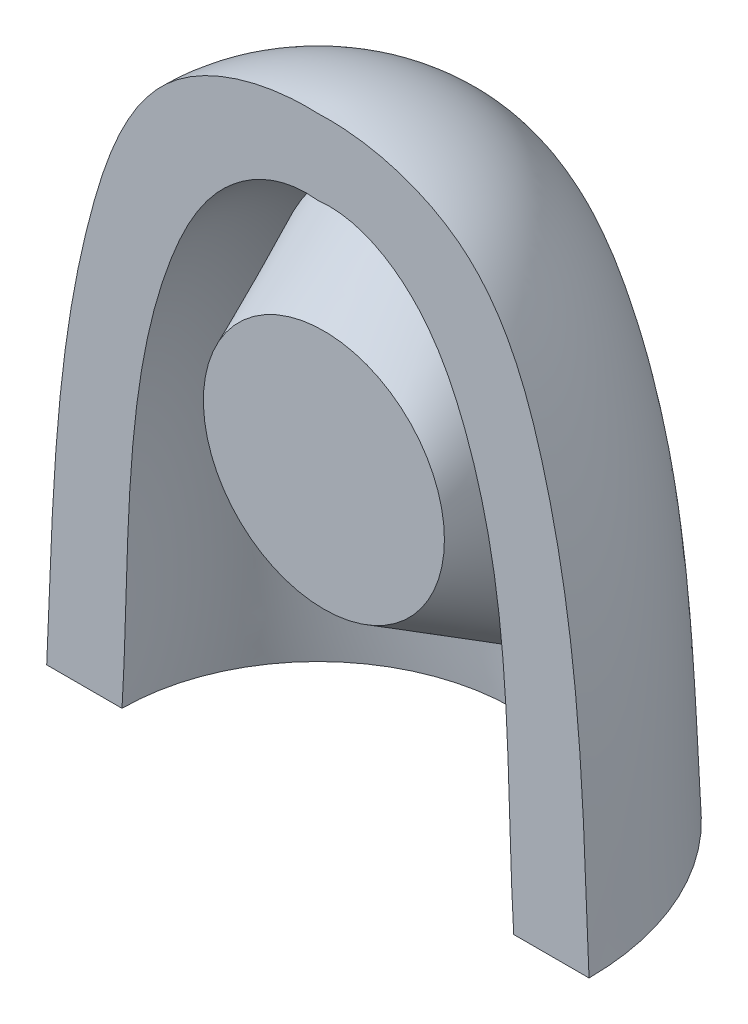
ISO-10303-21;
HEADER;
FILE_DESCRIPTION(('STEP AP214'),'2;1');
FILE_NAME('part.step','',(''),(''),'','','');
FILE_SCHEMA(('AUTOMOTIVE_DESIGN { 1 0 10303 214 1 1 1 1 }'));
ENDSEC;
DATA;
#1=APPLICATION_CONTEXT('core data for automotive mechanical design processes');
#2=APPLICATION_PROTOCOL_DEFINITION('international standard','automotive_design',2000,#1);
#3=PRODUCT_CONTEXT('',#1,'mechanical');
#4=PRODUCT('Part','Part','',(#3));
#5=PRODUCT_RELATED_PRODUCT_CATEGORY('part','',(#4));
#6=PRODUCT_DEFINITION_FORMATION('','',#4);
#7=PRODUCT_DEFINITION_CONTEXT('part definition',#1,'design');
#8=PRODUCT_DEFINITION('design','',#6,#7);
#9=PRODUCT_DEFINITION_SHAPE('','',#8);
#10=(LENGTH_UNIT() NAMED_UNIT(*) SI_UNIT(.MILLI.,.METRE.));
#11=(NAMED_UNIT(*) PLANE_ANGLE_UNIT() SI_UNIT($,.RADIAN.));
#12=(NAMED_UNIT(*) SI_UNIT($,.STERADIAN.) SOLID_ANGLE_UNIT());
#13=UNCERTAINTY_MEASURE_WITH_UNIT(LENGTH_MEASURE(1.E-05),#10,'distance_accuracy_value','');
#14=(GEOMETRIC_REPRESENTATION_CONTEXT(3) GLOBAL_UNCERTAINTY_ASSIGNED_CONTEXT((#13)) GLOBAL_UNIT_ASSIGNED_CONTEXT((#10,
#11,#12)) REPRESENTATION_CONTEXT('',''));
#15=CARTESIAN_POINT('',(0.,0.,0.));
#16=DIRECTION('',(0.,0.,1.));
#17=DIRECTION('',(1.,0.,0.));
#18=AXIS2_PLACEMENT_3D('',#15,#16,#17);
#19=CARTESIAN_POINT('',(0.,17.85,0.));
#20=CARTESIAN_POINT('',(1.24846861298638,18.0031040687306,0.));
#21=CARTESIAN_POINT('',(3.43429537377529,16.8333496800897,0.));
#22=CARTESIAN_POINT('',(6.61729731931612,10.514055415151,0.));
#23=CARTESIAN_POINT('',(6.22039885602234,4.53230718925359,0.));
#24=CARTESIAN_POINT('',(6.5,0.,0.));
#25=B_SPLINE_CURVE_WITH_KNOTS('',3,(#19,#20,#21,#22,#23,#24),.UNSPECIFIED.,.F.,.F.,(4,1,1,4),
(0.,0.174730571842795,0.328981961247271,1.),.UNSPECIFIED.);
#26=CARTESIAN_POINT('',(0.,24.0801939058172,0.));
#27=DIRECTION('',(0.,1.,0.));
#28=AXIS1_PLACEMENT('',#26,#27);
#29=SURFACE_OF_REVOLUTION('',#25,#28);
#30=CARTESIAN_POINT('',(0.0020915848185156,2.10960871057088,-6.40433988911454));
#31=CARTESIAN_POINT('',(-0.0708569881289167,2.10956412934809,-6.40436483947934));
#32=CARTESIAN_POINT('',(-0.143820161504329,2.1125245953033,-6.403039200509));
#33=CARTESIAN_POINT('',(-0.289191099643609,2.12438044368944,-6.39772245300576));
#34=CARTESIAN_POINT('',(-0.361598567726914,2.13327879978048,-6.39373000895173));
#35=CARTESIAN_POINT('',(-0.505424532298662,2.15679904663749,-6.38318046961311));
#36=CARTESIAN_POINT('',(-0.576840915376655,2.1714316581982,-6.37661857047984));
#37=CARTESIAN_POINT('',(-0.71809990100843,2.2060626964334,-6.36109977369957));
#38=CARTESIAN_POINT('',(-0.787942105151076,2.22606246532002,-6.35214227696638));
#39=CARTESIAN_POINT('',(-0.942697186108103,2.27654083775309,-6.32955644530142));
#40=CARTESIAN_POINT('',(-1.02707692664279,2.30838737906419,-6.31532097046922));
#41=CARTESIAN_POINT('',(-1.19237724724958,2.37882640621484,-6.28388464182202));
#42=CARTESIAN_POINT('',(-1.27329680390788,2.41742087093598,-6.26668291815161));
#43=CARTESIAN_POINT('',(-1.51069709547456,2.54206160076244,-6.21123456497845));
#44=CARTESIAN_POINT('',(-1.66171331327344,2.63692860289526,-6.16916119398285));
#45=CARTESIAN_POINT('',(-1.91858290965893,2.82197900959212,-6.08749022668997));
#46=CARTESIAN_POINT('',(-2.02726287588152,2.90896658572295,-6.04922631631876));
#47=CARTESIAN_POINT('',(-2.23601295083798,3.09142418062774,-5.96930464082069));
#48=CARTESIAN_POINT('',(-2.33607778371883,3.18689932541828,-5.92764482603622));
#49=CARTESIAN_POINT('',(-2.52830310506569,3.38470068355162,-5.84173474937058));
#50=CARTESIAN_POINT('',(-2.62044955110319,3.48703851756509,-5.79748011041532));
#51=CARTESIAN_POINT('',(-2.79732755531567,3.69716418454633,-5.70707165713343));
#52=CARTESIAN_POINT('',(-2.88205646899014,3.80495393979976,-5.66091717402629));
#53=CARTESIAN_POINT('',(-3.10853799753057,4.11139481180069,-5.53042036952204));
#54=CARTESIAN_POINT('',(-3.24282527731999,4.31493196323852,-5.4445497478761));
#55=CARTESIAN_POINT('',(-3.49227987021986,4.73247323282894,-5.27040050122229));
#56=CARTESIAN_POINT('',(-3.60743239095343,4.94648528481659,-5.18212007409689));
#57=CARTESIAN_POINT('',(-3.82055071137058,5.38300417592443,-5.00446370138272));
#58=CARTESIAN_POINT('',(-3.91848288010651,5.60552662657318,-4.91508596892476));
#59=CARTESIAN_POINT('',(-4.09799914477339,6.05707843877154,-4.73664231810548));
#60=CARTESIAN_POINT('',(-4.17958735677264,6.28610614540358,-4.64757632680075));
#61=CARTESIAN_POINT('',(-4.3329031953632,6.76816052659066,-4.46384822078006));
#62=CARTESIAN_POINT('',(-4.4033293994588,7.02164660056617,-4.36930482722826));
#63=CARTESIAN_POINT('',(-4.5259609673557,7.5342037376134,-4.18346426966213));
#64=CARTESIAN_POINT('',(-4.57816354728988,7.79327564757296,-4.09216760353408));
#65=CARTESIAN_POINT('',(-4.66375875292131,8.31562374402757,-3.91493301615965));
#66=CARTESIAN_POINT('',(-4.69719648700688,8.57888827010772,-3.8289826895035));
#67=CARTESIAN_POINT('',(-4.74449519890044,9.10945900848066,-3.66447599364041));
#68=CARTESIAN_POINT('',(-4.75835973517393,9.37676447718447,-3.58591828285844));
#69=CARTESIAN_POINT('',(-4.76485401570195,9.88445808285047,-3.44693358562823));
#70=CARTESIAN_POINT('',(-4.75967604204868,10.1245297451881,-3.38546177695564));
#71=CARTESIAN_POINT('',(-4.73191750734739,10.6059463532829,-3.27207753381726));
#72=CARTESIAN_POINT('',(-4.70933836996635,10.8472911932715,-3.22016431775074));
#73=CARTESIAN_POINT('',(-4.64599946393165,11.3300200492387,-3.12704250513668));
#74=CARTESIAN_POINT('',(-4.605215405899,11.5714036854306,-3.08584832677081));
#75=CARTESIAN_POINT('',(-4.50507244617037,12.0519555290966,-3.01456678155678));
#76=CARTESIAN_POINT('',(-4.44571544330206,12.2911239604724,-2.98447827999133));
#77=CARTESIAN_POINT('',(-4.33110769664228,12.6867147534407,-2.9429318331391));
#78=CARTESIAN_POINT('',(-4.28098786463004,12.8443507170639,-2.92860322335643));
#79=CARTESIAN_POINT('',(-4.17241146567782,13.1571157919313,-2.90419756863058));
#80=CARTESIAN_POINT('',(-4.11395331159204,13.3122444196474,-2.89412133454849));
#81=CARTESIAN_POINT('',(-4.02000865585465,13.5425702858932,-2.88184459356193));
#82=CARTESIAN_POINT('',(-3.98763745520783,13.6189794766683,-2.87822445088125));
#83=CARTESIAN_POINT('',(-3.92081173444161,13.7709191107547,-2.87188565262475));
#84=CARTESIAN_POINT('',(-3.88635721118352,13.8464495527419,-2.86916699840713));
#85=CARTESIAN_POINT('',(-3.77994463464216,14.0712248532689,-2.86209886685079));
#86=CARTESIAN_POINT('',(-3.7047923893066,14.2190114544797,-2.85881959205362));
#87=CARTESIAN_POINT('',(-3.54535411974324,14.5094950123395,-2.85364396907614));
#88=CARTESIAN_POINT('',(-3.46107341300462,14.6521948683952,-2.85174682070678));
#89=CARTESIAN_POINT('',(-3.28262745296555,14.9311384088015,-2.84822269511668));
#90=CARTESIAN_POINT('',(-3.18847226846649,15.0673884679704,-2.84659544697334));
#91=CARTESIAN_POINT('',(-3.01636723532609,15.2960035574114,-2.8433573257632));
#92=CARTESIAN_POINT('',(-2.94093062730496,15.3902636579433,-2.84186127406869));
#93=CARTESIAN_POINT('',(-2.78405678572373,15.573654406779,-2.83844154231021));
#94=CARTESIAN_POINT('',(-2.70262018750083,15.6627855964067,-2.83651790747951));
#95=CARTESIAN_POINT('',(-2.53361386514956,15.8348785696554,-2.83218091598689));
#96=CARTESIAN_POINT('',(-2.44605002743217,15.9178461208357,-2.82976802523316));
#97=CARTESIAN_POINT('',(-2.26463591338562,16.0766203985347,-2.82450005536822));
#98=CARTESIAN_POINT('',(-2.17078553541921,16.1524270092316,-2.82164496910687));
#99=CARTESIAN_POINT('',(-1.97560384963993,16.2966559612997,-2.81560676443468));
#100=CARTESIAN_POINT('',(-1.87418940433929,16.3649662248574,-2.81241977597319));
#101=CARTESIAN_POINT('',(-1.66535289278492,16.4917454228639,-2.80599531741932));
#102=CARTESIAN_POINT('',(-1.55793064304281,16.550214056514,-2.80275784578729));
#103=CARTESIAN_POINT('',(-1.33782318964937,16.6560416134726,-2.79656401327956));
#104=CARTESIAN_POINT('',(-1.22514236393391,16.7034095873471,-2.79360742457281));
#105=CARTESIAN_POINT('',(-0.995384991583199,16.7859556335366,-2.78827469985162));
#106=CARTESIAN_POINT('',(-0.878309501484574,16.8211366152277,-2.78589842533997));
#107=CARTESIAN_POINT('',(-0.658669435766282,16.874107624819,-2.78225533281317));
#108=CARTESIAN_POINT('',(-0.556540903823032,16.8937075049154,-2.78087598161021));
#109=CARTESIAN_POINT('',(-0.3508684837704,16.9229972507388,-2.77881256138667));
#110=CARTESIAN_POINT('',(-0.247324795738096,16.9326885029726,-2.77812839508948));
#111=CARTESIAN_POINT('',(-0.0398418284304384,16.9419499244056,-2.77751025361071));
#112=CARTESIAN_POINT('',(0.064097197811978,16.9415257392048,-2.77757585995744));
#113=CARTESIAN_POINT('',(0.271432732411801,16.9305801555938,-2.77845322670263));
#114=CARTESIAN_POINT('',(0.374829279239084,16.9200594831786,-2.77926493345203));
#115=CARTESIAN_POINT('',(0.566833758816475,16.8911511798752,-2.78142491781185));
#116=CARTESIAN_POINT('',(0.655624528932224,16.8739572531294,-2.7826902028213));
#117=CARTESIAN_POINT('',(0.831504043807087,16.8323698643011,-2.78566825391461));
#118=CARTESIAN_POINT('',(0.918592277692034,16.8079742755506,-2.78738115216254));
#119=CARTESIAN_POINT('',(1.17644842361009,16.7245203783846,-2.79306243536523));
#120=CARTESIAN_POINT('',(1.34396735602191,16.65517005955,-2.79757547059619));
#121=CARTESIAN_POINT('',(1.67617955683188,16.4880123610861,-2.80733529231591));
#122=CARTESIAN_POINT('',(1.84014729522356,16.3887895033268,-2.81260943661007));
#123=CARTESIAN_POINT('',(2.15263470176869,16.1685671174152,-2.82251749502565));
#124=CARTESIAN_POINT('',(2.30115209717038,16.0475643925628,-2.82715131498794));
#125=CARTESIAN_POINT('',(2.55769426321428,15.8112380859879,-2.83449270960922));
#126=CARTESIAN_POINT('',(2.66825616585447,15.6986286981409,-2.83739548582358));
#127=CARTESIAN_POINT('',(2.87904043260439,15.4640374970136,-2.84238813107886));
#128=CARTESIAN_POINT('',(2.97925731401878,15.3420507730387,-2.84447757067331));
#129=CARTESIAN_POINT('',(3.17025160857457,15.0901959891613,-2.84817982664803));
#130=CARTESIAN_POINT('',(3.26099065540581,14.9602990284269,-2.84979075106298));
#131=CARTESIAN_POINT('',(3.43330757808216,14.6945943993062,-2.85317378215909));
#132=CARTESIAN_POINT('',(3.51488498620099,14.5587864296378,-2.85494589706111));
#133=CARTESIAN_POINT('',(3.66949197444238,14.2826159476041,-2.85959083806343));
#134=CARTESIAN_POINT('',(3.74253086267488,14.1422586120038,-2.86246245068174));
#135=CARTESIAN_POINT('',(3.84620201240065,13.9289123188619,-2.86850567830334));
#136=CARTESIAN_POINT('',(3.87978390496686,13.8573141136516,-2.87081001448926));
#137=CARTESIAN_POINT('',(3.94504796192724,13.7132854469489,-2.87618675661416));
#138=CARTESIAN_POINT('',(3.97673013089233,13.6408549874596,-2.87925916070498));
#139=CARTESIAN_POINT('',(4.06894947177465,13.4224117226339,-2.88972926420718));
#140=CARTESIAN_POINT('',(4.12665748473286,13.275251147367,-2.89837974976504));
#141=CARTESIAN_POINT('',(4.23441374177672,12.9787378878223,-2.91939859181829));
#142=CARTESIAN_POINT('',(4.28447621395774,12.8293898565274,-2.93175991217131));
#143=CARTESIAN_POINT('',(4.37705576819536,12.5287823310381,-2.96057064370592));
#144=CARTESIAN_POINT('',(4.41957404918419,12.377523144667,-2.97701940430726));
#145=CARTESIAN_POINT('',(4.4970630917968,12.0736412837007,-3.0142623216204));
#146=CARTESIAN_POINT('',(4.53203471460767,11.9210187667542,-3.03505598198027));
#147=CARTESIAN_POINT('',(4.61019914089511,11.5377540668715,-3.092745863154));
#148=CARTESIAN_POINT('',(4.64865471136178,11.3065511181569,-3.13247632694785));
#149=CARTESIAN_POINT('',(4.70889901814767,10.8439027796285,-3.2218220338529));
#150=CARTESIAN_POINT('',(4.7306859392645,10.6124573661579,-3.27143835278434));
#151=CARTESIAN_POINT('',(4.75825094435845,10.150477218653,-3.37955385393308));
#152=CARTESIAN_POINT('',(4.76401352479785,9.9199435818894,-3.43806158091751));
#153=CARTESIAN_POINT('',(4.76030040898101,9.46105856586889,-3.56242293093044));
#154=CARTESIAN_POINT('',(4.75082602144962,9.23270700088529,-3.6282759226116));
#155=CARTESIAN_POINT('',(4.71131057878903,8.69521303753866,-3.79106617400188));
#156=CARTESIAN_POINT('',(4.67498053765802,8.38728646121019,-3.89051987268951));
#157=CARTESIAN_POINT('',(4.57702497184684,7.77857296504061,-4.09632506951647));
#158=CARTESIAN_POINT('',(4.51544707785884,7.47777372350061,-4.20266326350089));
#159=CARTESIAN_POINT('',(4.36796030663166,6.88484486697677,-4.41909638727928));
#160=CARTESIAN_POINT('',(4.28213704583222,6.59268867168884,-4.52917691970679));
#161=CARTESIAN_POINT('',(4.08532910169946,6.01628598206125,-4.75150038688596));
#162=CARTESIAN_POINT('',(3.97424628552101,5.73207532458557,-4.86375015004437));
#163=CARTESIAN_POINT('',(3.75079756399527,5.23184732026523,-5.06490252456705));
#164=CARTESIAN_POINT('',(3.64327682022917,5.01370597926622,-5.15391551189916));
#165=CARTESIAN_POINT('',(3.40969565574115,4.58643896065376,-5.33036285351077));
#166=CARTESIAN_POINT('',(3.28361799441552,4.37732190339178,-5.41779565395068));
#167=CARTESIAN_POINT('',(3.07938943720559,4.0735799282586,-5.54608042834452));
#168=CARTESIAN_POINT('',(3.00901051862302,3.97425009762132,-5.58825157131183));
#169=CARTESIAN_POINT('',(2.86276704744225,3.77922539730327,-5.67143987506675));
#170=CARTESIAN_POINT('',(2.7869037988142,3.68352967176685,-5.71245730696336));
#171=CARTESIAN_POINT('',(2.6294053927592,3.49660732257269,-5.79292318569717));
#172=CARTESIAN_POINT('',(2.54778019128081,3.40537342993786,-5.83237416335038));
#173=CARTESIAN_POINT('',(2.37822236701487,3.22813281965119,-5.90931870304691));
#174=CARTESIAN_POINT('',(2.29029272966117,3.14212366303327,-5.9468131772376));
#175=CARTESIAN_POINT('',(2.13440426694946,3.000746710029,-6.00866448786857));
#176=CARTESIAN_POINT('',(2.06814397955236,2.94378561832244,-6.03365142105411));
#177=CARTESIAN_POINT('',(1.93210672367886,2.83358064037554,-6.08210797057951));
#178=CARTESIAN_POINT('',(1.86233001391062,2.78033648136067,-6.10557769825316));
#179=CARTESIAN_POINT('',(1.64733061964729,2.6269518773397,-6.17333408821294));
#180=CARTESIAN_POINT('',(1.4964601170616,2.53317924031415,-6.21495921881673));
#181=CARTESIAN_POINT('',(1.25809455181815,2.4095079032998,-6.27002707315476));
#182=CARTESIAN_POINT('',(1.17592812505428,2.37087854672736,-6.28726124176441));
#183=CARTESIAN_POINT('',(1.00810949364361,2.30062047462155,-6.31864940808378));
#184=CARTESIAN_POINT('',(0.922459731265248,2.26898695097068,-6.33280552117579));
#185=CARTESIAN_POINT('',(0.748426895253357,2.21374443403574,-6.35755312562282));
#186=CARTESIAN_POINT('',(0.660054247556336,2.19010818767938,-6.36815672198535));
#187=CARTESIAN_POINT('',(0.481097806562474,2.15157089614822,-6.38545827150658));
#188=CARTESIAN_POINT('',(0.390516229656675,2.13666144227185,-6.39215998429242));
#189=CARTESIAN_POINT('',(0.250043111117269,2.12085870105591,-6.3992680178214));
#190=CARTESIAN_POINT('',(0.200574251280583,2.11667301312986,-6.40115205160131));
#191=CARTESIAN_POINT('',(0.101436404090931,2.11106292871881,-6.40367961260394));
#192=CARTESIAN_POINT('',(0.0517673797116886,2.10963906904933,-6.40432289866285));
#193=CARTESIAN_POINT('',(0.0020915848185156,2.10960871057088,-6.40433988911454));
#194=B_SPLINE_CURVE_WITH_KNOTS('',3,(#30,#31,#32,#33,#34,#35,#36,#37,#38,#39,#40,#41,#42,#43,
#44,#45,#46,#47,#48,#49,#50,#51,#52,#53,#54,#55,#56,#57,#58,#59,#60,#61,#62,#63,#64,#65,#66,#67,
#68,#69,#70,#71,#72,#73,#74,#75,#76,#77,#78,#79,#80,#81,#82,#83,#84,#85,#86,#87,#88,#89,#90,#91,
#92,#93,#94,#95,#96,#97,#98,#99,#100,#101,#102,#103,#104,#105,#106,#107,#108,#109,#110,#111,
#112,#113,#114,#115,#116,#117,#118,#119,#120,#121,#122,#123,#124,#125,#126,#127,#128,#129,#130,
#131,#132,#133,#134,#135,#136,#137,#138,#139,#140,#141,#142,#143,#144,#145,#146,#147,#148,#149,
#150,#151,#152,#153,#154,#155,#156,#157,#158,#159,#160,#161,#162,#163,#164,#165,#166,#167,#168,
#169,#170,#171,#172,#173,#174,#175,#176,#177,#178,#179,#180,#181,#182,#183,#184,#185,#186,#187,
#188,#189,#190,#191,#192,#193),.UNSPECIFIED.,.T.,.F.,(4,2,2,2,2,2,2,2,2,2,2,2,2,2,2,2,2,2,2,2,2,
2,2,2,2,2,2,2,2,2,2,2,2,2,2,2,2,2,2,2,2,2,2,2,2,2,2,2,2,2,2,2,2,2,2,2,2,2,2,2,2,2,2,2,2,2,2,2,2,
2,2,2,2,2,2,2,2,2,2,2,2,4),(0.,0.218793595614524,0.437696844074444,0.657011322869655,
0.876380698753431,1.14987316654216,1.42344597308415,1.97092774670762,2.4035045594256,
2.83634442261791,3.26993668830388,3.70368291417081,4.47801615827222,5.25294525368674,
6.02937135307766,6.80560167051813,7.64360510631164,8.48173650075882,9.3178444037696,
10.1538002802957,10.8966866613706,11.6395122700421,12.3833319481318,13.1270756057431,
13.6249177864782,14.1228548550298,14.3720116903665,14.6211689010855,15.1183255860945,
15.6151942105002,16.1115610255343,16.473554558921,16.8355098158575,17.1971219956142,
17.558740023126,17.9251851660209,18.2916415068809,18.6577980217173,19.023867064408,
19.3354102029167,19.6469097414611,19.9582354308144,20.2695387357528,20.5405723931306,
20.8116861675927,21.3534348382311,21.9265588468859,22.4997670434594,22.9726273080615,
23.445736908058,23.9206929354428,24.3956731995974,24.8701307466298,25.1074531129379,
25.3447749082012,25.8194322035548,26.2931951219262,26.766882681739,27.2405161580665,
27.9528145771527,28.6651905539218,29.3782555145186,30.0912592322221,31.0668325503478,
32.0405738322263,33.0109186728709,33.9850997160642,34.7613733029825,35.5383727058345,
35.9247349073233,36.3110055464459,36.6966243653993,37.0820617674453,37.3545499574635,
37.6270181293238,38.1720455929238,38.4489898019845,38.7257430763385,39.0015435031395,
39.2770777430739,39.426040682425,39.5750325727464),.UNSPECIFIED.);
#195=CARTESIAN_POINT('',(0.0020915848185156,2.10960871057088,-6.40433988911454));
#196=VERTEX_POINT('',#195);
#197=EDGE_CURVE('E47',#196,#196,#194,.T.);
#198=ORIENTED_EDGE('',*,*,#197,.T.);
#199=EDGE_LOOP('',(#198));
#200=FACE_BOUND('',#199,.T.);
#201=CARTESIAN_POINT('',(0.,17.85,0.));
#202=CARTESIAN_POINT('',(1.24846861298638,18.0031040687306,0.));
#203=CARTESIAN_POINT('',(3.43429537377529,16.8333496800897,0.));
#204=CARTESIAN_POINT('',(6.61729731931612,10.514055415151,0.));
#205=CARTESIAN_POINT('',(6.22039885602234,4.53230718925359,0.));
#206=CARTESIAN_POINT('',(6.5,0.,0.));
#207=B_SPLINE_CURVE_WITH_KNOTS('',3,(#201,#202,#203,#204,#205,#206),.UNSPECIFIED.,.F.,.F.,(4,1,
1,4),(0.,0.174730571842795,0.328981961247271,1.),.UNSPECIFIED.);
#208=CARTESIAN_POINT('',(6.5,0.,0.));
#209=VERTEX_POINT('',#208);
#210=CARTESIAN_POINT('',(0.,17.85,0.));
#211=VERTEX_POINT('',#210);
#212=EDGE_CURVE('E92',#209,#211,#207,.F.);
#213=ORIENTED_EDGE('',*,*,#212,.T.);
#214=CARTESIAN_POINT('',(0.,17.85,0.));
#215=CARTESIAN_POINT('',(-1.24846861298638,18.0031040687306,0.));
#216=CARTESIAN_POINT('',(-3.43429537377529,16.8333496800897,0.));
#217=CARTESIAN_POINT('',(-6.61729731931612,10.514055415151,0.));
#218=CARTESIAN_POINT('',(-6.22039885602234,4.53230718925359,0.));
#219=CARTESIAN_POINT('',(-6.5,0.,0.));
#220=B_SPLINE_CURVE_WITH_KNOTS('',3,(#214,#215,#216,#217,#218,#219),.UNSPECIFIED.,.F.,.F.,(4,1,
1,4),(0.,0.174730571842795,0.328981961247271,1.),.UNSPECIFIED.);
#221=CARTESIAN_POINT('',(-6.5,0.,0.));
#222=VERTEX_POINT('',#221);
#223=EDGE_CURVE('E69',#211,#222,#220,.T.);
#224=ORIENTED_EDGE('',*,*,#223,.T.);
#225=CARTESIAN_POINT('',(0.,0.,0.));
#226=DIRECTION('',(0.,1.,0.));
#227=DIRECTION('',(0.,0.,1.));
#228=AXIS2_PLACEMENT_3D('',#225,#226,#227);
#229=CIRCLE('',#228,6.5);
#230=EDGE_CURVE('E84',#209,#222,#229,.T.);
#231=ORIENTED_EDGE('',*,*,#230,.F.);
#232=EDGE_LOOP('',(#213,#224,#231));
#233=FACE_BOUND('',#232,.T.);
#234=ADVANCED_FACE('F42',(#200,#233),#29,.T.);
#235=CARTESIAN_POINT('',(6.5,0.,0.));
#236=DIRECTION('',(0.,1.,0.));
#237=DIRECTION('',(0.,0.,1.));
#238=AXIS2_PLACEMENT_3D('',#235,#236,#237);
#239=PLANE('',#238);
#240=CARTESIAN_POINT('',(0.,0.,0.));
#241=DIRECTION('',(0.,1.,0.));
#242=DIRECTION('',(0.,0.,1.));
#243=AXIS2_PLACEMENT_3D('',#240,#241,#242);
#244=CIRCLE('',#243,9.);
#245=CARTESIAN_POINT('',(9.,0.,0.));
#246=VERTEX_POINT('',#245);
#247=CARTESIAN_POINT('',(-9.,0.,0.));
#248=VERTEX_POINT('',#247);
#249=EDGE_CURVE('E87',#246,#248,#244,.T.);
#250=ORIENTED_EDGE('',*,*,#249,.F.);
#251=DIRECTION('',(-1.,0.,0.));
#252=VECTOR('',#251,1.);
#253=CARTESIAN_POINT('',(6.5,0.,0.));
#254=LINE('',#253,#252);
#255=EDGE_CURVE('E63',#246,#209,#254,.T.);
#256=ORIENTED_EDGE('',*,*,#255,.T.);
#257=ORIENTED_EDGE('',*,*,#230,.T.);
#258=EDGE_CURVE('E133',#222,#248,#254,.T.);
#259=ORIENTED_EDGE('',*,*,#258,.T.);
#260=EDGE_LOOP('',(#250,#256,#257,#259));
#261=FACE_BOUND('',#260,.T.);
#262=ADVANCED_FACE('F117',(#261),#239,.F.);
#263=CARTESIAN_POINT('',(9.,0.,0.));
#264=CARTESIAN_POINT('',(8.79405712052161,4.78562399546529,0.));
#265=CARTESIAN_POINT('',(8.74052008463889,10.9419840515826,0.));
#266=CARTESIAN_POINT('',(5.66035992992067,19.3724701488857,0.));
#267=CARTESIAN_POINT('',(1.67596684179475,20.428176516065,0.));
#268=CARTESIAN_POINT('',(0.,20.35,0.));
#269=B_SPLINE_CURVE_WITH_KNOTS('',3,(#263,#264,#265,#266,#267,#268),.UNSPECIFIED.,.F.,.F.,(4,1,
1,4),(0.,0.559571261485386,0.790913026252223,1.),.UNSPECIFIED.);
#270=CARTESIAN_POINT('',(0.,24.0801939058172,0.));
#271=DIRECTION('',(0.,1.,0.));
#272=AXIS1_PLACEMENT('',#270,#271);
#273=SURFACE_OF_REVOLUTION('',#269,#272);
#274=ORIENTED_EDGE('',*,*,#249,.T.);
#275=CARTESIAN_POINT('',(-9.,0.,0.));
#276=CARTESIAN_POINT('',(-8.79405712052161,4.78562399546529,0.));
#277=CARTESIAN_POINT('',(-8.74052008463889,10.9419840515826,0.));
#278=CARTESIAN_POINT('',(-5.66035992992067,19.3724701488857,0.));
#279=CARTESIAN_POINT('',(-1.67596684179475,20.428176516065,0.));
#280=CARTESIAN_POINT('',(0.,20.35,0.));
#281=B_SPLINE_CURVE_WITH_KNOTS('',3,(#275,#276,#277,#278,#279,#280),.UNSPECIFIED.,.F.,.F.,(4,1,
1,4),(0.,0.559571261485386,0.790913026252223,1.),.UNSPECIFIED.);
#282=CARTESIAN_POINT('',(0.,20.35,0.));
#283=VERTEX_POINT('',#282);
#284=EDGE_CURVE('E12',#248,#283,#281,.T.);
#285=ORIENTED_EDGE('',*,*,#284,.T.);
#286=CARTESIAN_POINT('',(9.,0.,0.));
#287=CARTESIAN_POINT('',(8.79405712052161,4.78562399546529,0.));
#288=CARTESIAN_POINT('',(8.74052008463889,10.9419840515826,0.));
#289=CARTESIAN_POINT('',(5.66035992992067,19.3724701488857,0.));
#290=CARTESIAN_POINT('',(1.67596684179475,20.428176516065,0.));
#291=CARTESIAN_POINT('',(0.,20.35,0.));
#292=B_SPLINE_CURVE_WITH_KNOTS('',3,(#286,#287,#288,#289,#290,#291),.UNSPECIFIED.,.F.,.F.,(4,1,
1,4),(0.,0.559571261485386,0.790913026252223,1.),.UNSPECIFIED.);
#293=EDGE_CURVE('E56',#283,#246,#292,.F.);
#294=ORIENTED_EDGE('',*,*,#293,.T.);
#295=EDGE_LOOP('',(#274,#285,#294));
#296=FACE_BOUND('',#295,.T.);
#297=ADVANCED_FACE('F86',(#296),#273,.T.);
#298=CARTESIAN_POINT('',(0.,0.,0.));
#299=DIRECTION('',(0.,0.,-1.));
#300=DIRECTION('',(-1.,0.,0.));
#301=AXIS2_PLACEMENT_3D('',#298,#299,#300);
#302=PLANE('',#301);
#303=ORIENTED_EDGE('',*,*,#212,.F.);
#304=ORIENTED_EDGE('',*,*,#255,.F.);
#305=ORIENTED_EDGE('',*,*,#293,.F.);
#306=ORIENTED_EDGE('',*,*,#284,.F.);
#307=ORIENTED_EDGE('',*,*,#258,.F.);
#308=ORIENTED_EDGE('',*,*,#223,.F.);
#309=EDGE_LOOP('',(#303,#304,#305,#306,#307,#308));
#310=FACE_BOUND('',#309,.T.);
#311=ADVANCED_FACE('F79',(#310),#302,.F.);
#312=CARTESIAN_POINT('',(0.,1.34442836067456,-7.62463211967203));
#313=CARTESIAN_POINT('',(0.0127258433969379,6.0000202434375,-0.2));
#314=CARTESIAN_POINT('',(10.7840059564523,1.34442836067456,-7.62463211967203));
#315=CARTESIAN_POINT('',(8.01268535652195,6.02547193023137,-0.2));
#316=CARTESIAN_POINT('',(10.7840059564523,18.9321072751506,-4.52344979901253));
#317=CARTESIAN_POINT('',(7.98723366972807,14.0254314433564,-0.2));
#318=CARTESIAN_POINT('',(0.,18.9321072751506,-4.52344979901253));
#319=CARTESIAN_POINT('',(-0.0127258433969384,13.9999797565625,-0.2));
#320=CARTESIAN_POINT('',(-10.7840059564523,18.9321072751506,-4.52344979901253));
#321=CARTESIAN_POINT('',(-8.01268535652195,13.9745280697686,-0.2));
#322=CARTESIAN_POINT('',(-10.7840059564523,1.34442836067456,-7.62463211967203));
#323=CARTESIAN_POINT('',(-7.98723366972807,5.97456855664362,-0.2));
#324=CARTESIAN_POINT('',(0.,1.34442836067456,-7.62463211967203));
#325=CARTESIAN_POINT('',(0.0127258433969379,6.0000202434375,-0.2));
#326=(BOUNDED_SURFACE() B_SPLINE_SURFACE(3,1,((#312,#313),(#314,#315),(#316,#317),(#318,#319),
(#320,#321),(#322,#323),(#324,#325)),.UNSPECIFIED.,.T.,.F.,.F.) B_SPLINE_SURFACE_WITH_KNOTS((4,
3,4),(2,2),(0.,0.5,1.),(0.,1.),
.UNSPECIFIED.) GEOMETRIC_REPRESENTATION_ITEM() RATIONAL_B_SPLINE_SURFACE(((1.,1.),
(0.333333333333333,0.333333333333333),(0.333333333333333,0.333333333333333),(1.,1.),
(0.333333333333333,0.333333333333333),(0.333333333333333,0.333333333333333),(1.,1.))) REPRESENTATION_ITEM('') SURFACE());
#327=CARTESIAN_POINT('',(0.,10.,-0.2));
#328=DIRECTION('',(0.,0.,1.));
#329=DIRECTION('',(1.,0.,0.));
#330=AXIS2_PLACEMENT_3D('',#327,#328,#329);
#331=CIRCLE('',#330,4.);
#332=CARTESIAN_POINT('',(4.,10.,-0.2));
#333=VERTEX_POINT('',#332);
#334=EDGE_CURVE('E148',#333,#333,#331,.T.);
#335=ORIENTED_EDGE('',*,*,#334,.F.);
#336=EDGE_LOOP('',(#335));
#337=FACE_BOUND('',#336,.T.);
#338=ORIENTED_EDGE('',*,*,#197,.F.);
#339=EDGE_LOOP('',(#338));
#340=FACE_BOUND('',#339,.T.);
#341=ADVANCED_FACE('F163',(#337,#340),#326,.T.);
#342=CARTESIAN_POINT('',(0.,10.,-0.2));
#343=DIRECTION('',(0.,0.,1.));
#344=DIRECTION('',(1.,0.,0.));
#345=AXIS2_PLACEMENT_3D('',#342,#343,#344);
#346=PLANE('',#345);
#347=ORIENTED_EDGE('',*,*,#334,.T.);
#348=EDGE_LOOP('',(#347));
#349=FACE_BOUND('',#348,.T.);
#350=ADVANCED_FACE('F155',(#349),#346,.T.);
#351=CLOSED_SHELL('',(#234,#262,#297,#311,#341,#350));
#352=MANIFOLD_SOLID_BREP('B2',#351);
#353=ADVANCED_BREP_SHAPE_REPRESENTATION('',(#18,#352),#14);
#354=SHAPE_DEFINITION_REPRESENTATION(#9,#353);
ENDSEC;
END-ISO-10303-21;
